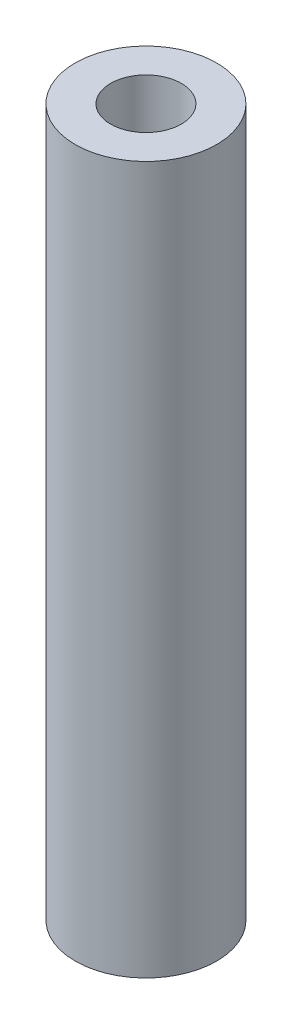
ISO-10303-21;
HEADER;
FILE_DESCRIPTION(('STEP AP214'),'2;1');
FILE_NAME('part.step','',(''),(''),'','','');
FILE_SCHEMA(('AUTOMOTIVE_DESIGN { 1 0 10303 214 1 1 1 1 }'));
ENDSEC;
DATA;
#1=APPLICATION_CONTEXT('core data for automotive mechanical design processes');
#2=APPLICATION_PROTOCOL_DEFINITION('international standard','automotive_design',2000,#1);
#3=PRODUCT_CONTEXT('',#1,'mechanical');
#4=PRODUCT('Part','Part','',(#3));
#5=PRODUCT_RELATED_PRODUCT_CATEGORY('part','',(#4));
#6=PRODUCT_DEFINITION_FORMATION('','',#4);
#7=PRODUCT_DEFINITION_CONTEXT('part definition',#1,'design');
#8=PRODUCT_DEFINITION('design','',#6,#7);
#9=PRODUCT_DEFINITION_SHAPE('','',#8);
#10=(LENGTH_UNIT() NAMED_UNIT(*) SI_UNIT(.MILLI.,.METRE.));
#11=(NAMED_UNIT(*) PLANE_ANGLE_UNIT() SI_UNIT($,.RADIAN.));
#12=(NAMED_UNIT(*) SI_UNIT($,.STERADIAN.) SOLID_ANGLE_UNIT());
#13=UNCERTAINTY_MEASURE_WITH_UNIT(LENGTH_MEASURE(1.E-05),#10,'distance_accuracy_value','');
#14=(GEOMETRIC_REPRESENTATION_CONTEXT(3) GLOBAL_UNCERTAINTY_ASSIGNED_CONTEXT((#13)) GLOBAL_UNIT_ASSIGNED_CONTEXT((#10,
#11,#12)) REPRESENTATION_CONTEXT('',''));
#15=CARTESIAN_POINT('',(0.,0.,0.));
#16=DIRECTION('',(0.,0.,1.));
#17=DIRECTION('',(1.,0.,0.));
#18=AXIS2_PLACEMENT_3D('',#15,#16,#17);
#19=CARTESIAN_POINT('',(0.,5.,0.));
#20=DIRECTION('',(0.,1.,0.));
#21=DIRECTION('',(0.,0.,1.));
#22=AXIS2_PLACEMENT_3D('',#19,#20,#21);
#23=PLANE('',#22);
#24=CARTESIAN_POINT('',(0.,5.,0.));
#25=DIRECTION('',(0.,1.,0.));
#26=DIRECTION('',(0.,0.,1.));
#27=AXIS2_PLACEMENT_3D('',#24,#25,#26);
#28=CIRCLE('',#27,0.5);
#29=CARTESIAN_POINT('',(0.,5.,0.5));
#30=VERTEX_POINT('',#29);
#31=EDGE_CURVE('E10',#30,#30,#28,.T.);
#32=ORIENTED_EDGE('',*,*,#31,.T.);
#33=EDGE_LOOP('',(#32));
#34=FACE_BOUND('',#33,.T.);
#35=CARTESIAN_POINT('',(0.,5.,0.));
#36=DIRECTION('',(0.,1.,0.));
#37=DIRECTION('',(0.,0.,1.));
#38=AXIS2_PLACEMENT_3D('',#35,#36,#37);
#39=CIRCLE('',#38,0.25);
#40=CARTESIAN_POINT('',(0.,5.,0.25));
#41=VERTEX_POINT('',#40);
#42=EDGE_CURVE('E45',#41,#41,#39,.T.);
#43=ORIENTED_EDGE('',*,*,#42,.F.);
#44=EDGE_LOOP('',(#43));
#45=FACE_BOUND('',#44,.T.);
#46=ADVANCED_FACE('F34',(#34,#45),#23,.T.);
#47=CARTESIAN_POINT('',(0.,0.,0.));
#48=DIRECTION('',(0.,1.,0.));
#49=DIRECTION('',(0.,0.,1.));
#50=AXIS2_PLACEMENT_3D('',#47,#48,#49);
#51=PLANE('',#50);
#52=CARTESIAN_POINT('',(0.,0.,0.));
#53=DIRECTION('',(0.,1.,0.));
#54=DIRECTION('',(0.,0.,1.));
#55=AXIS2_PLACEMENT_3D('',#52,#53,#54);
#56=CIRCLE('',#55,0.5);
#57=CARTESIAN_POINT('',(0.,0.,0.5));
#58=VERTEX_POINT('',#57);
#59=EDGE_CURVE('E38',#58,#58,#56,.T.);
#60=ORIENTED_EDGE('',*,*,#59,.F.);
#61=EDGE_LOOP('',(#60));
#62=FACE_BOUND('',#61,.T.);
#63=CARTESIAN_POINT('',(0.,0.,0.));
#64=DIRECTION('',(0.,1.,0.));
#65=DIRECTION('',(0.,0.,1.));
#66=AXIS2_PLACEMENT_3D('',#63,#64,#65);
#67=CIRCLE('',#66,0.25);
#68=CARTESIAN_POINT('',(0.,0.,0.25));
#69=VERTEX_POINT('',#68);
#70=EDGE_CURVE('E47',#69,#69,#67,.T.);
#71=ORIENTED_EDGE('',*,*,#70,.T.);
#72=EDGE_LOOP('',(#71));
#73=FACE_BOUND('',#72,.T.);
#74=ADVANCED_FACE('F57',(#62,#73),#51,.F.);
#75=CARTESIAN_POINT('',(0.,5.,0.));
#76=DIRECTION('',(0.,-1.,0.));
#77=DIRECTION('',(0.,0.,-1.));
#78=AXIS2_PLACEMENT_3D('',#75,#76,#77);
#79=CYLINDRICAL_SURFACE('',#78,0.5);
#80=ORIENTED_EDGE('',*,*,#31,.F.);
#81=EDGE_LOOP('',(#80));
#82=FACE_BOUND('',#81,.T.);
#83=ORIENTED_EDGE('',*,*,#59,.T.);
#84=EDGE_LOOP('',(#83));
#85=FACE_BOUND('',#84,.T.);
#86=ADVANCED_FACE('F36',(#82,#85),#79,.T.);
#87=CARTESIAN_POINT('',(0.,5.,0.));
#88=DIRECTION('',(0.,-1.,0.));
#89=DIRECTION('',(0.,0.,-1.));
#90=AXIS2_PLACEMENT_3D('',#87,#88,#89);
#91=CYLINDRICAL_SURFACE('',#90,0.25);
#92=ORIENTED_EDGE('',*,*,#42,.T.);
#93=EDGE_LOOP('',(#92));
#94=FACE_BOUND('',#93,.T.);
#95=ORIENTED_EDGE('',*,*,#70,.F.);
#96=EDGE_LOOP('',(#95));
#97=FACE_BOUND('',#96,.T.);
#98=ADVANCED_FACE('F53',(#94,#97),#91,.F.);
#99=CLOSED_SHELL('',(#46,#74,#86,#98));
#100=MANIFOLD_SOLID_BREP('B2',#99);
#101=ADVANCED_BREP_SHAPE_REPRESENTATION('',(#18,#100),#14);
#102=SHAPE_DEFINITION_REPRESENTATION(#9,#101);
ENDSEC;
END-ISO-10303-21;
